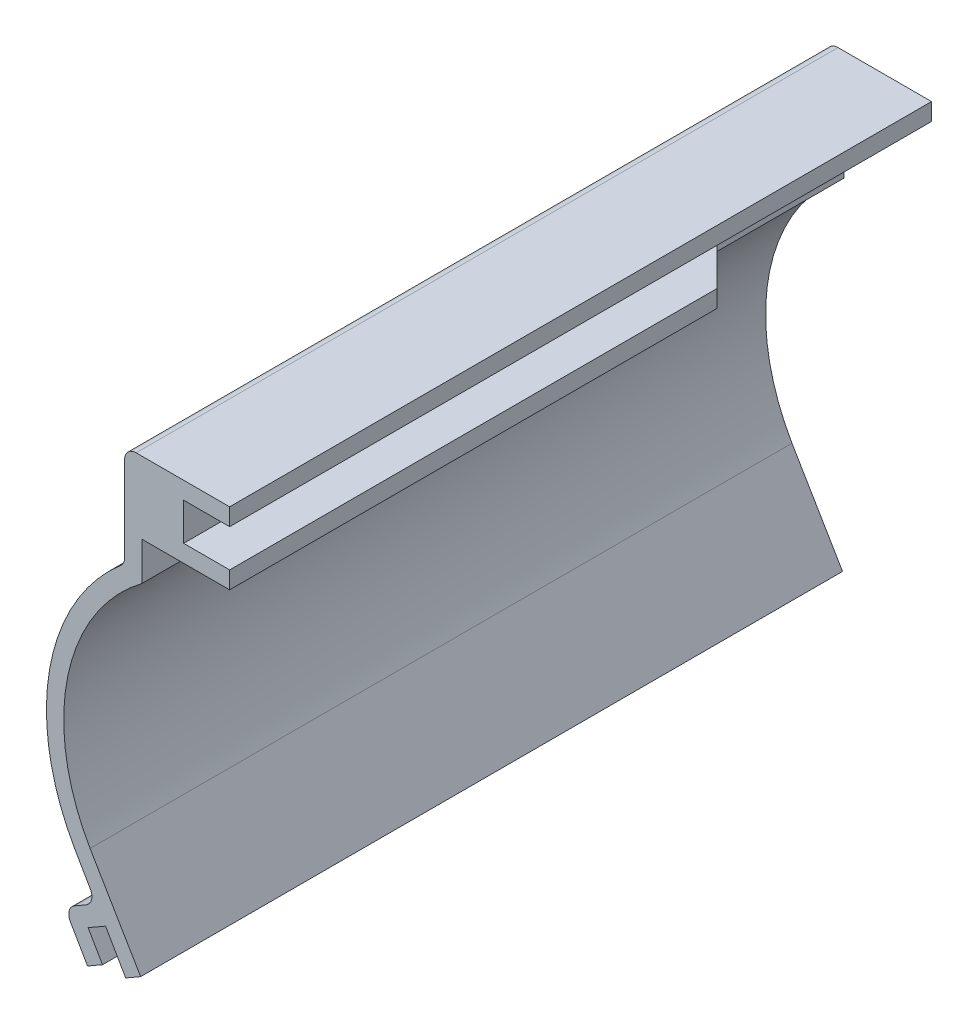
ISO-10303-21;
HEADER;
FILE_DESCRIPTION(('STEP AP214'),'2;1');
FILE_NAME('part.step','',(''),(''),'','','');
FILE_SCHEMA(('AUTOMOTIVE_DESIGN { 1 0 10303 214 1 1 1 1 }'));
ENDSEC;
DATA;
#1=APPLICATION_CONTEXT('core data for automotive mechanical design processes');
#2=APPLICATION_PROTOCOL_DEFINITION('international standard','automotive_design',2000,#1);
#3=PRODUCT_CONTEXT('',#1,'mechanical');
#4=PRODUCT('Part','Part','',(#3));
#5=PRODUCT_RELATED_PRODUCT_CATEGORY('part','',(#4));
#6=PRODUCT_DEFINITION_FORMATION('','',#4);
#7=PRODUCT_DEFINITION_CONTEXT('part definition',#1,'design');
#8=PRODUCT_DEFINITION('design','',#6,#7);
#9=PRODUCT_DEFINITION_SHAPE('','',#8);
#10=(LENGTH_UNIT() NAMED_UNIT(*) SI_UNIT(.MILLI.,.METRE.));
#11=(NAMED_UNIT(*) PLANE_ANGLE_UNIT() SI_UNIT($,.RADIAN.));
#12=(NAMED_UNIT(*) SI_UNIT($,.STERADIAN.) SOLID_ANGLE_UNIT());
#13=UNCERTAINTY_MEASURE_WITH_UNIT(LENGTH_MEASURE(1.E-05),#10,'distance_accuracy_value','');
#14=(GEOMETRIC_REPRESENTATION_CONTEXT(3) GLOBAL_UNCERTAINTY_ASSIGNED_CONTEXT((#13)) GLOBAL_UNIT_ASSIGNED_CONTEXT((#10,
#11,#12)) REPRESENTATION_CONTEXT('',''));
#15=CARTESIAN_POINT('',(0.,0.,0.));
#16=DIRECTION('',(0.,0.,1.));
#17=DIRECTION('',(1.,0.,0.));
#18=AXIS2_PLACEMENT_3D('',#15,#16,#17);
#19=CARTESIAN_POINT('',(-16.4489778170774,50.5859978889031,122.));
#20=DIRECTION('',(0.,1.,0.));
#21=DIRECTION('',(-1.,0.,0.));
#22=AXIS2_PLACEMENT_3D('',#19,#20,#21);
#23=PLANE('',#22);
#24=DIRECTION('',(1.,0.,0.));
#25=VECTOR('',#24,1.);
#26=CARTESIAN_POINT('',(-16.4489778170774,50.5859978889031,0.));
#27=LINE('',#26,#25);
#28=CARTESIAN_POINT('',(-24.4489778170773,50.5859978889031,0.));
#29=VERTEX_POINT('',#28);
#30=CARTESIAN_POINT('',(-16.4489778170774,50.5859978889031,0.));
#31=VERTEX_POINT('',#30);
#32=EDGE_CURVE('E247',#29,#31,#27,.T.);
#33=ORIENTED_EDGE('',*,*,#32,.T.);
#34=DIRECTION('',(0.,0.,-1.));
#35=VECTOR('',#34,1.);
#36=CARTESIAN_POINT('',(-16.4489778170774,50.5859978889031,122.));
#37=LINE('',#36,#35);
#38=CARTESIAN_POINT('',(-16.4489778170774,50.5859978889031,122.));
#39=VERTEX_POINT('',#38);
#40=EDGE_CURVE('E354',#39,#31,#37,.T.);
#41=ORIENTED_EDGE('',*,*,#40,.F.);
#42=DIRECTION('',(1.,0.,0.));
#43=VECTOR('',#42,1.);
#44=CARTESIAN_POINT('',(-16.4489778170774,50.5859978889031,122.));
#45=LINE('',#44,#43);
#46=CARTESIAN_POINT('',(-24.4489778170773,50.5859978889031,122.));
#47=VERTEX_POINT('',#46);
#48=EDGE_CURVE('E294',#47,#39,#45,.T.);
#49=ORIENTED_EDGE('',*,*,#48,.F.);
#50=DIRECTION('',(0.,0.,-1.));
#51=VECTOR('',#50,1.);
#52=CARTESIAN_POINT('',(-24.4489778170773,50.5859978889031,122.));
#53=LINE('',#52,#51);
#54=EDGE_CURVE('E241',#47,#29,#53,.T.);
#55=ORIENTED_EDGE('',*,*,#54,.T.);
#56=EDGE_LOOP('',(#33,#41,#49,#55));
#57=FACE_BOUND('',#56,.T.);
#58=ADVANCED_FACE('F43',(#57),#23,.F.);
#59=CARTESIAN_POINT('',(-16.4489778170774,53.5859978889031,122.));
#60=DIRECTION('',(-1.,0.,0.));
#61=DIRECTION('',(0.,0.,1.));
#62=AXIS2_PLACEMENT_3D('',#59,#60,#61);
#63=PLANE('',#62);
#64=DIRECTION('',(0.,1.,0.));
#65=VECTOR('',#64,1.);
#66=CARTESIAN_POINT('',(-16.4489778170774,53.5859978889031,0.));
#67=LINE('',#66,#65);
#68=CARTESIAN_POINT('',(-16.4489778170774,53.5859978889031,0.));
#69=VERTEX_POINT('',#68);
#70=EDGE_CURVE('E250',#31,#69,#67,.T.);
#71=ORIENTED_EDGE('',*,*,#70,.T.);
#72=DIRECTION('',(0.,0.,-1.));
#73=VECTOR('',#72,1.);
#74=CARTESIAN_POINT('',(-16.4489778170774,53.5859978889031,122.));
#75=LINE('',#74,#73);
#76=CARTESIAN_POINT('',(-16.4489778170774,53.5859978889031,122.));
#77=VERTEX_POINT('',#76);
#78=EDGE_CURVE('E351',#77,#69,#75,.T.);
#79=ORIENTED_EDGE('',*,*,#78,.F.);
#80=DIRECTION('',(0.,1.,0.));
#81=VECTOR('',#80,1.);
#82=CARTESIAN_POINT('',(-16.4489778170774,53.5859978889031,122.));
#83=LINE('',#82,#81);
#84=EDGE_CURVE('E389',#39,#77,#83,.T.);
#85=ORIENTED_EDGE('',*,*,#84,.F.);
#86=ORIENTED_EDGE('',*,*,#40,.T.);
#87=EDGE_LOOP('',(#71,#79,#85,#86));
#88=FACE_BOUND('',#87,.T.);
#89=ADVANCED_FACE('F508',(#88),#63,.F.);
#90=CARTESIAN_POINT('',(-32.6989778170773,53.5859978889031,122.));
#91=DIRECTION('',(0.,-1.,0.));
#92=DIRECTION('',(1.,0.,0.));
#93=AXIS2_PLACEMENT_3D('',#90,#91,#92);
#94=PLANE('',#93);
#95=DIRECTION('',(-1.,0.,0.));
#96=VECTOR('',#95,1.);
#97=CARTESIAN_POINT('',(-32.6989778170773,53.5859978889031,0.));
#98=LINE('',#97,#96);
#99=CARTESIAN_POINT('',(-32.6989778170773,53.5859978889031,0.));
#100=VERTEX_POINT('',#99);
#101=EDGE_CURVE('E252',#69,#100,#98,.T.);
#102=ORIENTED_EDGE('',*,*,#101,.T.);
#103=DIRECTION('',(0.,0.,-1.));
#104=VECTOR('',#103,1.);
#105=CARTESIAN_POINT('',(-32.6989778170773,53.5859978889031,122.));
#106=LINE('',#105,#104);
#107=CARTESIAN_POINT('',(-32.6989778170773,53.5859978889031,122.));
#108=VERTEX_POINT('',#107);
#109=EDGE_CURVE('E348',#108,#100,#106,.T.);
#110=ORIENTED_EDGE('',*,*,#109,.F.);
#111=DIRECTION('',(-1.,0.,0.));
#112=VECTOR('',#111,1.);
#113=CARTESIAN_POINT('',(-32.6989778170773,53.5859978889031,122.));
#114=LINE('',#113,#112);
#115=EDGE_CURVE('E391',#77,#108,#114,.T.);
#116=ORIENTED_EDGE('',*,*,#115,.F.);
#117=ORIENTED_EDGE('',*,*,#78,.T.);
#118=EDGE_LOOP('',(#102,#110,#116,#117));
#119=FACE_BOUND('',#118,.T.);
#120=ADVANCED_FACE('F505',(#119),#94,.F.);
#121=CARTESIAN_POINT('',(-32.6989778170773,51.5859978889031,122.));
#122=DIRECTION('',(0.,0.,-1.));
#123=DIRECTION('',(-1.,0.,0.));
#124=AXIS2_PLACEMENT_3D('',#121,#122,#123);
#125=CYLINDRICAL_SURFACE('',#124,2.00000000000001);
#126=CARTESIAN_POINT('',(-32.6989778170773,51.5859978889031,0.));
#127=DIRECTION('',(0.,0.,1.));
#128=DIRECTION('',(-1.,0.,0.));
#129=AXIS2_PLACEMENT_3D('',#126,#127,#128);
#130=CIRCLE('',#129,2.00000000000001);
#131=CARTESIAN_POINT('',(-34.6989778170773,51.5859978889031,0.));
#132=VERTEX_POINT('',#131);
#133=EDGE_CURVE('E254',#100,#132,#130,.T.);
#134=ORIENTED_EDGE('',*,*,#133,.T.);
#135=DIRECTION('',(0.,0.,-1.));
#136=VECTOR('',#135,1.);
#137=CARTESIAN_POINT('',(-34.6989778170773,51.5859978889031,122.));
#138=LINE('',#137,#136);
#139=CARTESIAN_POINT('',(-34.6989778170773,51.5859978889031,122.));
#140=VERTEX_POINT('',#139);
#141=EDGE_CURVE('E345',#140,#132,#138,.T.);
#142=ORIENTED_EDGE('',*,*,#141,.F.);
#143=CARTESIAN_POINT('',(-32.6989778170773,51.5859978889031,122.));
#144=DIRECTION('',(0.,0.,1.));
#145=DIRECTION('',(-1.,0.,0.));
#146=AXIS2_PLACEMENT_3D('',#143,#144,#145);
#147=CIRCLE('',#146,2.00000000000001);
#148=EDGE_CURVE('E396',#108,#140,#147,.T.);
#149=ORIENTED_EDGE('',*,*,#148,.F.);
#150=ORIENTED_EDGE('',*,*,#109,.T.);
#151=EDGE_LOOP('',(#134,#142,#149,#150));
#152=FACE_BOUND('',#151,.T.);
#153=ADVANCED_FACE('F501',(#152),#125,.T.);
#154=CARTESIAN_POINT('',(-34.6989778170773,36.8022063918843,122.));
#155=DIRECTION('',(1.,0.,0.));
#156=DIRECTION('',(0.,0.,-1.));
#157=AXIS2_PLACEMENT_3D('',#154,#155,#156);
#158=PLANE('',#157);
#159=DIRECTION('',(0.,-1.,0.));
#160=VECTOR('',#159,1.);
#161=CARTESIAN_POINT('',(-34.6989778170773,36.8022063918843,0.));
#162=LINE('',#161,#160);
#163=CARTESIAN_POINT('',(-34.6989778170773,36.8022063918843,0.));
#164=VERTEX_POINT('',#163);
#165=EDGE_CURVE('E256',#132,#164,#162,.T.);
#166=ORIENTED_EDGE('',*,*,#165,.T.);
#167=DIRECTION('',(0.,0.,-1.));
#168=VECTOR('',#167,1.);
#169=CARTESIAN_POINT('',(-34.6989778170773,36.8022063918843,122.));
#170=LINE('',#169,#168);
#171=CARTESIAN_POINT('',(-34.6989778170773,36.8022063918843,122.));
#172=VERTEX_POINT('',#171);
#173=EDGE_CURVE('E342',#172,#164,#170,.T.);
#174=ORIENTED_EDGE('',*,*,#173,.F.);
#175=DIRECTION('',(0.,-1.,0.));
#176=VECTOR('',#175,1.);
#177=CARTESIAN_POINT('',(-34.6989778170773,36.8022063918843,122.));
#178=LINE('',#177,#176);
#179=EDGE_CURVE('E398',#140,#172,#178,.T.);
#180=ORIENTED_EDGE('',*,*,#179,.F.);
#181=ORIENTED_EDGE('',*,*,#141,.T.);
#182=EDGE_LOOP('',(#166,#174,#180,#181));
#183=FACE_BOUND('',#182,.T.);
#184=ADVANCED_FACE('F496',(#183),#158,.F.);
#185=CARTESIAN_POINT('',(-36.6989778170773,36.8022063918843,122.));
#186=DIRECTION('',(0.,0.,-1.));
#187=DIRECTION('',(-1.,0.,0.));
#188=AXIS2_PLACEMENT_3D('',#185,#186,#187);
#189=CYLINDRICAL_SURFACE('',#188,2.);
#190=CARTESIAN_POINT('',(-36.6989778170773,36.8022063918843,0.));
#191=DIRECTION('',(0.,0.,-1.));
#192=DIRECTION('',(-1.,0.,0.));
#193=AXIS2_PLACEMENT_3D('',#190,#191,#192);
#194=CIRCLE('',#193,2.);
#195=CARTESIAN_POINT('',(-35.3924000451399,35.2879889286781,0.));
#196=VERTEX_POINT('',#195);
#197=EDGE_CURVE('E258',#164,#196,#194,.T.);
#198=ORIENTED_EDGE('',*,*,#197,.T.);
#199=DIRECTION('',(0.,0.,-1.));
#200=VECTOR('',#199,1.);
#201=CARTESIAN_POINT('',(-35.3924000451399,35.2879889286781,122.));
#202=LINE('',#201,#200);
#203=CARTESIAN_POINT('',(-35.3924000451399,35.2879889286781,122.));
#204=VERTEX_POINT('',#203);
#205=EDGE_CURVE('E339',#204,#196,#202,.T.);
#206=ORIENTED_EDGE('',*,*,#205,.F.);
#207=CARTESIAN_POINT('',(-36.6989778170773,36.8022063918843,122.));
#208=DIRECTION('',(0.,0.,-1.));
#209=DIRECTION('',(-1.,0.,0.));
#210=AXIS2_PLACEMENT_3D('',#207,#208,#209);
#211=CIRCLE('',#210,2.);
#212=EDGE_CURVE('E400',#172,#204,#211,.T.);
#213=ORIENTED_EDGE('',*,*,#212,.F.);
#214=ORIENTED_EDGE('',*,*,#173,.T.);
#215=EDGE_LOOP('',(#198,#206,#213,#214));
#216=FACE_BOUND('',#215,.T.);
#217=ADVANCED_FACE('F490',(#216),#189,.F.);
#218=CARTESIAN_POINT('',(-11.090053487103,7.12354411304068,122.));
#219=DIRECTION('',(0.,0.,-1.));
#220=DIRECTION('',(-1.,0.,0.));
#221=AXIS2_PLACEMENT_3D('',#218,#219,#220);
#222=CYLINDRICAL_SURFACE('',#221,37.2000000000002);
#223=CARTESIAN_POINT('',(-11.090053487103,7.12354411304068,0.));
#224=DIRECTION('',(0.,0.,1.));
#225=DIRECTION('',(1.,0.,0.));
#226=AXIS2_PLACEMENT_3D('',#223,#224,#225);
#227=CIRCLE('',#226,37.2000000000002);
#228=CARTESIAN_POINT('',(-43.3061985078843,-11.4764558869595,0.));
#229=VERTEX_POINT('',#228);
#230=EDGE_CURVE('E260',#196,#229,#227,.T.);
#231=ORIENTED_EDGE('',*,*,#230,.T.);
#232=DIRECTION('',(0.,0.,-1.));
#233=VECTOR('',#232,1.);
#234=CARTESIAN_POINT('',(-43.3061985078843,-11.4764558869595,122.));
#235=LINE('',#234,#233);
#236=CARTESIAN_POINT('',(-43.3061985078843,-11.4764558869595,122.));
#237=VERTEX_POINT('',#236);
#238=EDGE_CURVE('E336',#237,#229,#235,.T.);
#239=ORIENTED_EDGE('',*,*,#238,.F.);
#240=CARTESIAN_POINT('',(-11.090053487103,7.12354411304068,122.));
#241=DIRECTION('',(0.,0.,1.));
#242=DIRECTION('',(1.,0.,0.));
#243=AXIS2_PLACEMENT_3D('',#240,#241,#242);
#244=CIRCLE('',#243,37.2000000000002);
#245=EDGE_CURVE('E402',#204,#237,#244,.T.);
#246=ORIENTED_EDGE('',*,*,#245,.F.);
#247=ORIENTED_EDGE('',*,*,#205,.T.);
#248=EDGE_LOOP('',(#231,#239,#246,#247));
#249=FACE_BOUND('',#248,.T.);
#250=ADVANCED_FACE('F486',(#249),#222,.T.);
#251=CARTESIAN_POINT('',(-43.3061985078843,-11.4764558869595,122.));
#252=DIRECTION('',(0.866025403784437,0.500000000000003,0.));
#253=DIRECTION('',(-0.500000000000003,0.866025403784437,0.));
#254=AXIS2_PLACEMENT_3D('',#251,#252,#253);
#255=PLANE('',#254);
#256=DIRECTION('',(0.500000000000003,-0.866025403784437,0.));
#257=VECTOR('',#256,1.);
#258=CARTESIAN_POINT('',(-43.3061985078843,-11.4764558869595,0.));
#259=LINE('',#258,#257);
#260=CARTESIAN_POINT('',(-40.6561985078843,-16.0663905270169,0.));
#261=VERTEX_POINT('',#260);
#262=EDGE_CURVE('E262',#229,#261,#259,.T.);
#263=ORIENTED_EDGE('',*,*,#262,.T.);
#264=DIRECTION('',(0.,0.,-1.));
#265=VECTOR('',#264,1.);
#266=CARTESIAN_POINT('',(-40.6561985078843,-16.0663905270169,122.));
#267=LINE('',#266,#265);
#268=CARTESIAN_POINT('',(-40.6561985078843,-16.0663905270169,122.));
#269=VERTEX_POINT('',#268);
#270=EDGE_CURVE('E333',#269,#261,#267,.T.);
#271=ORIENTED_EDGE('',*,*,#270,.F.);
#272=DIRECTION('',(0.500000000000003,-0.866025403784437,0.));
#273=VECTOR('',#272,1.);
#274=CARTESIAN_POINT('',(-43.3061985078843,-11.4764558869595,122.));
#275=LINE('',#274,#273);
#276=EDGE_CURVE('E404',#237,#269,#275,.T.);
#277=ORIENTED_EDGE('',*,*,#276,.F.);
#278=ORIENTED_EDGE('',*,*,#238,.T.);
#279=EDGE_LOOP('',(#263,#271,#277,#278));
#280=FACE_BOUND('',#279,.T.);
#281=ADVANCED_FACE('F481',(#280),#255,.F.);
#282=CARTESIAN_POINT('',(-42.3882493154532,-17.066390527017,122.));
#283=DIRECTION('',(0.,0.,-1.));
#284=DIRECTION('',(-1.,0.,0.));
#285=AXIS2_PLACEMENT_3D('',#282,#283,#284);
#286=CYLINDRICAL_SURFACE('',#285,2.);
#287=CARTESIAN_POINT('',(-42.3882493154532,-17.066390527017,0.));
#288=DIRECTION('',(0.,0.,-1.));
#289=DIRECTION('',(1.,0.,0.));
#290=AXIS2_PLACEMENT_3D('',#287,#288,#289);
#291=CIRCLE('',#290,2.);
#292=CARTESIAN_POINT('',(-41.3882493154532,-18.7984413345858,0.));
#293=VERTEX_POINT('',#292);
#294=EDGE_CURVE('E264',#261,#293,#291,.T.);
#295=ORIENTED_EDGE('',*,*,#294,.T.);
#296=DIRECTION('',(0.,0.,-1.));
#297=VECTOR('',#296,1.);
#298=CARTESIAN_POINT('',(-41.3882493154532,-18.7984413345858,122.));
#299=LINE('',#298,#297);
#300=CARTESIAN_POINT('',(-41.3882493154532,-18.7984413345858,122.));
#301=VERTEX_POINT('',#300);
#302=EDGE_CURVE('E330',#301,#293,#299,.T.);
#303=ORIENTED_EDGE('',*,*,#302,.F.);
#304=CARTESIAN_POINT('',(-42.3882493154532,-17.066390527017,122.));
#305=DIRECTION('',(0.,0.,-1.));
#306=DIRECTION('',(1.,0.,0.));
#307=AXIS2_PLACEMENT_3D('',#304,#305,#306);
#308=CIRCLE('',#307,2.);
#309=EDGE_CURVE('E406',#269,#301,#308,.T.);
#310=ORIENTED_EDGE('',*,*,#309,.F.);
#311=ORIENTED_EDGE('',*,*,#270,.T.);
#312=EDGE_LOOP('',(#295,#303,#310,#311));
#313=FACE_BOUND('',#312,.T.);
#314=ADVANCED_FACE('F475',(#313),#286,.F.);
#315=CARTESIAN_POINT('',(-41.3882493154532,-18.7984413345858,122.));
#316=DIRECTION('',(0.500000000000002,-0.866025403784437,0.));
#317=DIRECTION('',(0.866025403784437,0.500000000000002,0.));
#318=AXIS2_PLACEMENT_3D('',#315,#316,#317);
#319=PLANE('',#318);
#320=DIRECTION('',(-0.866025403784437,-0.500000000000002,0.));
#321=VECTOR('',#320,1.);
#322=CARTESIAN_POINT('',(-41.3882493154532,-18.7984413345858,0.));
#323=LINE('',#322,#321);
#324=CARTESIAN_POINT('',(-43.4125836967992,-19.9671913345858,0.));
#325=VERTEX_POINT('',#324);
#326=EDGE_CURVE('E266',#293,#325,#323,.T.);
#327=ORIENTED_EDGE('',*,*,#326,.T.);
#328=DIRECTION('',(0.,0.,-1.));
#329=VECTOR('',#328,1.);
#330=CARTESIAN_POINT('',(-43.4125836967992,-19.9671913345858,122.));
#331=LINE('',#330,#329);
#332=CARTESIAN_POINT('',(-43.4125836967992,-19.9671913345858,122.));
#333=VERTEX_POINT('',#332);
#334=EDGE_CURVE('E327',#333,#325,#331,.T.);
#335=ORIENTED_EDGE('',*,*,#334,.F.);
#336=DIRECTION('',(-0.866025403784437,-0.500000000000002,0.));
#337=VECTOR('',#336,1.);
#338=CARTESIAN_POINT('',(-41.3882493154532,-18.7984413345858,122.));
#339=LINE('',#338,#337);
#340=EDGE_CURVE('E408',#301,#333,#339,.T.);
#341=ORIENTED_EDGE('',*,*,#340,.F.);
#342=ORIENTED_EDGE('',*,*,#302,.T.);
#343=EDGE_LOOP('',(#327,#335,#341,#342));
#344=FACE_BOUND('',#343,.T.);
#345=ADVANCED_FACE('F471',(#344),#319,.F.);
#346=CARTESIAN_POINT('',(-42.4125836967992,-21.6992421421546,122.));
#347=DIRECTION('',(0.,0.,-1.));
#348=DIRECTION('',(-1.,0.,0.));
#349=AXIS2_PLACEMENT_3D('',#346,#347,#348);
#350=CYLINDRICAL_SURFACE('',#349,2.);
#351=CARTESIAN_POINT('',(-42.4125836967992,-21.6992421421546,0.));
#352=DIRECTION('',(0.,0.,1.));
#353=DIRECTION('',(1.,0.,0.));
#354=AXIS2_PLACEMENT_3D('',#351,#352,#353);
#355=CIRCLE('',#354,2.);
#356=CARTESIAN_POINT('',(-44.144634504368,-22.6992421421547,0.));
#357=VERTEX_POINT('',#356);
#358=EDGE_CURVE('E268',#325,#357,#355,.T.);
#359=ORIENTED_EDGE('',*,*,#358,.T.);
#360=DIRECTION('',(0.,0.,-1.));
#361=VECTOR('',#360,1.);
#362=CARTESIAN_POINT('',(-44.144634504368,-22.6992421421547,122.));
#363=LINE('',#362,#361);
#364=CARTESIAN_POINT('',(-44.144634504368,-22.6992421421547,122.));
#365=VERTEX_POINT('',#364);
#366=EDGE_CURVE('E324',#365,#357,#363,.T.);
#367=ORIENTED_EDGE('',*,*,#366,.F.);
#368=CARTESIAN_POINT('',(-42.4125836967992,-21.6992421421546,122.));
#369=DIRECTION('',(0.,0.,1.));
#370=DIRECTION('',(1.,0.,0.));
#371=AXIS2_PLACEMENT_3D('',#368,#369,#370);
#372=CIRCLE('',#371,2.);
#373=EDGE_CURVE('E410',#333,#365,#372,.T.);
#374=ORIENTED_EDGE('',*,*,#373,.F.);
#375=ORIENTED_EDGE('',*,*,#334,.T.);
#376=EDGE_LOOP('',(#359,#367,#374,#375));
#377=FACE_BOUND('',#376,.T.);
#378=ADVANCED_FACE('F466',(#377),#350,.T.);
#379=CARTESIAN_POINT('',(-44.144634504368,-22.6992421421547,122.));
#380=DIRECTION('',(0.866025403784438,0.500000000000001,0.));
#381=DIRECTION('',(-0.500000000000001,0.866025403784438,0.));
#382=AXIS2_PLACEMENT_3D('',#379,#380,#381);
#383=PLANE('',#382);
#384=DIRECTION('',(0.500000000000001,-0.866025403784438,0.));
#385=VECTOR('',#384,1.);
#386=CARTESIAN_POINT('',(-44.144634504368,-22.6992421421547,0.));
#387=LINE('',#386,#385);
#388=CARTESIAN_POINT('',(-41.144634504368,-27.8953945648613,0.));
#389=VERTEX_POINT('',#388);
#390=EDGE_CURVE('E270',#357,#389,#387,.T.);
#391=ORIENTED_EDGE('',*,*,#390,.T.);
#392=DIRECTION('',(0.,0.,-1.));
#393=VECTOR('',#392,1.);
#394=CARTESIAN_POINT('',(-41.144634504368,-27.8953945648613,122.));
#395=LINE('',#394,#393);
#396=CARTESIAN_POINT('',(-41.144634504368,-27.8953945648613,122.));
#397=VERTEX_POINT('',#396);
#398=EDGE_CURVE('E321',#397,#389,#395,.T.);
#399=ORIENTED_EDGE('',*,*,#398,.F.);
#400=DIRECTION('',(0.500000000000001,-0.866025403784438,0.));
#401=VECTOR('',#400,1.);
#402=CARTESIAN_POINT('',(-44.144634504368,-22.6992421421547,122.));
#403=LINE('',#402,#401);
#404=EDGE_CURVE('E412',#365,#397,#403,.T.);
#405=ORIENTED_EDGE('',*,*,#404,.F.);
#406=ORIENTED_EDGE('',*,*,#366,.T.);
#407=EDGE_LOOP('',(#391,#399,#405,#406));
#408=FACE_BOUND('',#407,.T.);
#409=ADVANCED_FACE('F460',(#408),#383,.F.);
#410=CARTESIAN_POINT('',(-41.144634504368,-27.8953945648613,122.));
#411=DIRECTION('',(-0.5,0.866025403784438,0.));
#412=DIRECTION('',(-0.866025403784438,-0.5,0.));
#413=AXIS2_PLACEMENT_3D('',#410,#411,#412);
#414=PLANE('',#413);
#415=DIRECTION('',(0.866025403784438,0.5,0.));
#416=VECTOR('',#415,1.);
#417=CARTESIAN_POINT('',(-41.144634504368,-27.8953945648613,0.));
#418=LINE('',#417,#416);
#419=CARTESIAN_POINT('',(-38.5465582930147,-26.3953945648613,0.));
#420=VERTEX_POINT('',#419);
#421=EDGE_CURVE('E272',#389,#420,#418,.T.);
#422=ORIENTED_EDGE('',*,*,#421,.T.);
#423=DIRECTION('',(0.,0.,-1.));
#424=VECTOR('',#423,1.);
#425=CARTESIAN_POINT('',(-38.5465582930147,-26.3953945648613,122.));
#426=LINE('',#425,#424);
#427=CARTESIAN_POINT('',(-38.5465582930147,-26.3953945648613,122.));
#428=VERTEX_POINT('',#427);
#429=EDGE_CURVE('E318',#428,#420,#426,.T.);
#430=ORIENTED_EDGE('',*,*,#429,.F.);
#431=DIRECTION('',(0.866025403784438,0.5,0.));
#432=VECTOR('',#431,1.);
#433=CARTESIAN_POINT('',(-41.144634504368,-27.8953945648613,122.));
#434=LINE('',#433,#432);
#435=EDGE_CURVE('E414',#397,#428,#434,.T.);
#436=ORIENTED_EDGE('',*,*,#435,.F.);
#437=ORIENTED_EDGE('',*,*,#398,.T.);
#438=EDGE_LOOP('',(#422,#430,#436,#437));
#439=FACE_BOUND('',#438,.T.);
#440=ADVANCED_FACE('F456',(#439),#414,.F.);
#441=CARTESIAN_POINT('',(-38.5465582930147,-26.3953945648613,122.));
#442=DIRECTION('',(-0.866025403784436,-0.500000000000004,0.));
#443=DIRECTION('',(0.500000000000004,-0.866025403784437,0.));
#444=AXIS2_PLACEMENT_3D('',#441,#442,#443);
#445=PLANE('',#444);
#446=DIRECTION('',(-0.500000000000004,0.866025403784436,0.));
#447=VECTOR('',#446,1.);
#448=CARTESIAN_POINT('',(-38.5465582930147,-26.3953945648613,0.));
#449=LINE('',#448,#447);
#450=CARTESIAN_POINT('',(-41.0465582930147,-22.0652675459391,0.));
#451=VERTEX_POINT('',#450);
#452=EDGE_CURVE('E274',#420,#451,#449,.T.);
#453=ORIENTED_EDGE('',*,*,#452,.T.);
#454=DIRECTION('',(0.,0.,-1.));
#455=VECTOR('',#454,1.);
#456=CARTESIAN_POINT('',(-41.0465582930147,-22.0652675459391,122.));
#457=LINE('',#456,#455);
#458=CARTESIAN_POINT('',(-41.0465582930147,-22.0652675459391,122.));
#459=VERTEX_POINT('',#458);
#460=EDGE_CURVE('E315',#459,#451,#457,.T.);
#461=ORIENTED_EDGE('',*,*,#460,.F.);
#462=DIRECTION('',(-0.500000000000004,0.866025403784436,0.));
#463=VECTOR('',#462,1.);
#464=CARTESIAN_POINT('',(-38.5465582930147,-26.3953945648613,122.));
#465=LINE('',#464,#463);
#466=EDGE_CURVE('E416',#428,#459,#465,.T.);
#467=ORIENTED_EDGE('',*,*,#466,.F.);
#468=ORIENTED_EDGE('',*,*,#429,.T.);
#469=EDGE_LOOP('',(#453,#461,#467,#468));
#470=FACE_BOUND('',#469,.T.);
#471=ADVANCED_FACE('F451',(#470),#445,.F.);
#472=CARTESIAN_POINT('',(-41.0465582930147,-22.0652675459391,122.));
#473=DIRECTION('',(-0.5,0.866025403784438,0.));
#474=DIRECTION('',(-0.866025403784439,-0.5,0.));
#475=AXIS2_PLACEMENT_3D('',#472,#473,#474);
#476=PLANE('',#475);
#477=DIRECTION('',(0.866025403784438,0.5,0.));
#478=VECTOR('',#477,1.);
#479=CARTESIAN_POINT('',(-41.0465582930147,-22.0652675459391,0.));
#480=LINE('',#479,#478);
#481=CARTESIAN_POINT('',(-38.0154693797692,-20.3152675459391,0.));
#482=VERTEX_POINT('',#481);
#483=EDGE_CURVE('E276',#451,#482,#480,.T.);
#484=ORIENTED_EDGE('',*,*,#483,.T.);
#485=DIRECTION('',(0.,0.,-1.));
#486=VECTOR('',#485,1.);
#487=CARTESIAN_POINT('',(-38.0154693797692,-20.3152675459391,122.));
#488=LINE('',#487,#486);
#489=CARTESIAN_POINT('',(-38.0154693797692,-20.3152675459391,122.));
#490=VERTEX_POINT('',#489);
#491=EDGE_CURVE('E312',#490,#482,#488,.T.);
#492=ORIENTED_EDGE('',*,*,#491,.F.);
#493=DIRECTION('',(0.866025403784438,0.5,0.));
#494=VECTOR('',#493,1.);
#495=CARTESIAN_POINT('',(-41.0465582930147,-22.0652675459391,122.));
#496=LINE('',#495,#494);
#497=EDGE_CURVE('E418',#459,#490,#496,.T.);
#498=ORIENTED_EDGE('',*,*,#497,.F.);
#499=ORIENTED_EDGE('',*,*,#460,.T.);
#500=EDGE_LOOP('',(#484,#492,#498,#499));
#501=FACE_BOUND('',#500,.T.);
#502=ADVANCED_FACE('F445',(#501),#476,.F.);
#503=CARTESIAN_POINT('',(-38.0154693797692,-20.3152675459391,122.));
#504=DIRECTION('',(0.866025403784437,0.500000000000003,0.));
#505=DIRECTION('',(-0.500000000000003,0.866025403784437,0.));
#506=AXIS2_PLACEMENT_3D('',#503,#504,#505);
#507=PLANE('',#506);
#508=DIRECTION('',(0.500000000000003,-0.866025403784437,0.));
#509=VECTOR('',#508,1.);
#510=CARTESIAN_POINT('',(-38.0154693797692,-20.3152675459391,0.));
#511=LINE('',#510,#509);
#512=CARTESIAN_POINT('',(-34.5154693797692,-26.3774453724301,0.));
#513=VERTEX_POINT('',#512);
#514=EDGE_CURVE('E278',#482,#513,#511,.T.);
#515=ORIENTED_EDGE('',*,*,#514,.T.);
#516=DIRECTION('',(0.,0.,-1.));
#517=VECTOR('',#516,1.);
#518=CARTESIAN_POINT('',(-34.5154693797692,-26.3774453724301,122.));
#519=LINE('',#518,#517);
#520=CARTESIAN_POINT('',(-34.5154693797692,-26.3774453724301,122.));
#521=VERTEX_POINT('',#520);
#522=EDGE_CURVE('E309',#521,#513,#519,.T.);
#523=ORIENTED_EDGE('',*,*,#522,.F.);
#524=DIRECTION('',(0.500000000000003,-0.866025403784437,0.));
#525=VECTOR('',#524,1.);
#526=CARTESIAN_POINT('',(-38.0154693797692,-20.3152675459391,122.));
#527=LINE('',#526,#525);
#528=EDGE_CURVE('E420',#490,#521,#527,.T.);
#529=ORIENTED_EDGE('',*,*,#528,.F.);
#530=ORIENTED_EDGE('',*,*,#491,.T.);
#531=EDGE_LOOP('',(#515,#523,#529,#530));
#532=FACE_BOUND('',#531,.T.);
#533=ADVANCED_FACE('F441',(#532),#507,.F.);
#534=CARTESIAN_POINT('',(-34.5154693797692,-26.3774453724301,122.));
#535=DIRECTION('',(-0.500000000000002,0.866025403784437,0.));
#536=DIRECTION('',(-0.866025403784437,-0.500000000000002,0.));
#537=AXIS2_PLACEMENT_3D('',#534,#535,#536);
#538=PLANE('',#537);
#539=DIRECTION('',(0.866025403784437,0.500000000000002,0.));
#540=VECTOR('',#539,1.);
#541=CARTESIAN_POINT('',(-34.5154693797692,-26.3774453724301,0.));
#542=LINE('',#541,#540);
#543=CARTESIAN_POINT('',(-31.9173931684159,-24.8774453724301,0.));
#544=VERTEX_POINT('',#543);
#545=EDGE_CURVE('E280',#513,#544,#542,.T.);
#546=ORIENTED_EDGE('',*,*,#545,.T.);
#547=DIRECTION('',(0.,0.,-1.));
#548=VECTOR('',#547,1.);
#549=CARTESIAN_POINT('',(-31.9173931684159,-24.8774453724301,122.));
#550=LINE('',#549,#548);
#551=CARTESIAN_POINT('',(-31.9173931684159,-24.8774453724301,122.));
#552=VERTEX_POINT('',#551);
#553=EDGE_CURVE('E306',#552,#544,#550,.T.);
#554=ORIENTED_EDGE('',*,*,#553,.F.);
#555=DIRECTION('',(0.866025403784437,0.500000000000002,0.));
#556=VECTOR('',#555,1.);
#557=CARTESIAN_POINT('',(-34.5154693797692,-26.3774453724301,122.));
#558=LINE('',#557,#556);
#559=EDGE_CURVE('E422',#521,#552,#558,.T.);
#560=ORIENTED_EDGE('',*,*,#559,.F.);
#561=ORIENTED_EDGE('',*,*,#522,.T.);
#562=EDGE_LOOP('',(#546,#554,#560,#561));
#563=FACE_BOUND('',#562,.T.);
#564=ADVANCED_FACE('F437',(#563),#538,.F.);
#565=CARTESIAN_POINT('',(-31.9173931684159,-24.8774453724301,122.));
#566=DIRECTION('',(-0.861290877137064,-0.508112216897476,0.));
#567=DIRECTION('',(0.508112216897476,-0.861290877137064,0.));
#568=AXIS2_PLACEMENT_3D('',#565,#566,#567);
#569=PLANE('',#568);
#570=DIRECTION('',(-0.508112216897476,0.861290877137064,0.));
#571=VECTOR('',#570,1.);
#572=CARTESIAN_POINT('',(-31.9173931684159,-24.8774453724301,0.));
#573=LINE('',#572,#571);
#574=CARTESIAN_POINT('',(-40.708122296531,-9.97645588695929,0.));
#575=VERTEX_POINT('',#574);
#576=EDGE_CURVE('E282',#544,#575,#573,.T.);
#577=ORIENTED_EDGE('',*,*,#576,.T.);
#578=DIRECTION('',(0.,0.,-1.));
#579=VECTOR('',#578,1.);
#580=CARTESIAN_POINT('',(-40.708122296531,-9.97645588695929,122.));
#581=LINE('',#580,#579);
#582=CARTESIAN_POINT('',(-40.708122296531,-9.97645588695929,122.));
#583=VERTEX_POINT('',#582);
#584=EDGE_CURVE('E303',#583,#575,#581,.T.);
#585=ORIENTED_EDGE('',*,*,#584,.F.);
#586=DIRECTION('',(-0.508112216897476,0.861290877137064,0.));
#587=VECTOR('',#586,1.);
#588=CARTESIAN_POINT('',(-31.9173931684159,-24.8774453724301,122.));
#589=LINE('',#588,#587);
#590=EDGE_CURVE('E243',#552,#583,#589,.T.);
#591=ORIENTED_EDGE('',*,*,#590,.F.);
#592=ORIENTED_EDGE('',*,*,#553,.T.);
#593=EDGE_LOOP('',(#577,#585,#591,#592));
#594=FACE_BOUND('',#593,.T.);
#595=ADVANCED_FACE('F428',(#594),#569,.F.);
#596=CARTESIAN_POINT('',(-11.0900534871031,7.12354411304068,122.));
#597=DIRECTION('',(0.,0.,-1.));
#598=DIRECTION('',(-1.,0.,0.));
#599=AXIS2_PLACEMENT_3D('',#596,#597,#598);
#600=CYLINDRICAL_SURFACE('',#599,34.2);
#601=CARTESIAN_POINT('',(-11.0900534871031,7.12354411304068,0.));
#602=DIRECTION('',(0.,0.,-1.));
#603=DIRECTION('',(1.,0.,0.));
#604=AXIS2_PLACEMENT_3D('',#601,#602,#603);
#605=CIRCLE('',#604,34.2);
#606=CARTESIAN_POINT('',(-31.6989778170773,34.4166245174472,0.));
#607=VERTEX_POINT('',#606);
#608=EDGE_CURVE('E284',#575,#607,#605,.T.);
#609=ORIENTED_EDGE('',*,*,#608,.T.);
#610=DIRECTION('',(0.,0.,-1.));
#611=VECTOR('',#610,1.);
#612=CARTESIAN_POINT('',(-31.6989778170773,34.4166245174472,122.));
#613=LINE('',#612,#611);
#614=CARTESIAN_POINT('',(-31.6989778170773,34.4166245174472,122.));
#615=VERTEX_POINT('',#614);
#616=EDGE_CURVE('E301',#615,#607,#613,.T.);
#617=ORIENTED_EDGE('',*,*,#616,.F.);
#618=CARTESIAN_POINT('',(-11.0900534871031,7.12354411304068,122.));
#619=DIRECTION('',(0.,0.,-1.));
#620=DIRECTION('',(1.,0.,0.));
#621=AXIS2_PLACEMENT_3D('',#618,#619,#620);
#622=CIRCLE('',#621,34.2);
#623=EDGE_CURVE('E237',#583,#615,#622,.T.);
#624=ORIENTED_EDGE('',*,*,#623,.F.);
#625=ORIENTED_EDGE('',*,*,#584,.T.);
#626=EDGE_LOOP('',(#609,#617,#624,#625));
#627=FACE_BOUND('',#626,.T.);
#628=ADVANCED_FACE('F432',(#627),#600,.F.);
#629=CARTESIAN_POINT('',(-31.6989778170773,47.6074172834728,122.));
#630=DIRECTION('',(-1.,0.,0.));
#631=DIRECTION('',(0.,-1.,0.));
#632=AXIS2_PLACEMENT_3D('',#629,#630,#631);
#633=PLANE('',#632);
#634=DIRECTION('',(0.,0.,-1.));
#635=VECTOR('',#634,1.);
#636=CARTESIAN_POINT('',(-31.6989778170773,47.6074172834728,122.));
#637=LINE('',#636,#635);
#638=CARTESIAN_POINT('',(-31.6989778170773,47.6074172834728,21.9999999999997));
#639=VERTEX_POINT('',#638);
#640=CARTESIAN_POINT('',(-31.6989778170773,47.6074172834728,0.));
#641=VERTEX_POINT('',#640);
#642=EDGE_CURVE('E299',#639,#641,#637,.T.);
#643=ORIENTED_EDGE('',*,*,#642,.F.);
#644=DIRECTION('',(0.,-1.,0.));
#645=VECTOR('',#644,1.);
#646=CARTESIAN_POINT('',(-31.6989778170773,47.6074172834728,21.9999999999996));
#647=LINE('',#646,#645);
#648=CARTESIAN_POINT('',(-31.6989778170773,41.0859978889031,21.9999999999996));
#649=VERTEX_POINT('',#648);
#650=EDGE_CURVE('E232',#639,#649,#647,.T.);
#651=ORIENTED_EDGE('',*,*,#650,.T.);
#652=DIRECTION('',(0.,0.,1.));
#653=VECTOR('',#652,1.);
#654=CARTESIAN_POINT('',(-31.6989778170773,41.0859978889031,42.));
#655=LINE('',#654,#653);
#656=CARTESIAN_POINT('',(-31.6989778170773,41.0859978889031,122.));
#657=VERTEX_POINT('',#656);
#658=EDGE_CURVE('E214',#649,#657,#655,.T.);
#659=ORIENTED_EDGE('',*,*,#658,.T.);
#660=DIRECTION('',(0.,1.,0.));
#661=VECTOR('',#660,1.);
#662=CARTESIAN_POINT('',(-31.6989778170773,47.6074172834728,122.));
#663=LINE('',#662,#661);
#664=EDGE_CURVE('E230',#615,#657,#663,.T.);
#665=ORIENTED_EDGE('',*,*,#664,.F.);
#666=ORIENTED_EDGE('',*,*,#616,.T.);
#667=DIRECTION('',(0.,1.,0.));
#668=VECTOR('',#667,1.);
#669=CARTESIAN_POINT('',(-31.6989778170773,47.6074172834728,0.));
#670=LINE('',#669,#668);
#671=EDGE_CURVE('E286',#607,#641,#670,.T.);
#672=ORIENTED_EDGE('',*,*,#671,.T.);
#673=EDGE_LOOP('',(#643,#651,#659,#665,#666,#672));
#674=FACE_BOUND('',#673,.T.);
#675=ADVANCED_FACE('F228',(#674),#633,.F.);
#676=CARTESIAN_POINT('',(-24.4489778170773,47.6074172834728,122.));
#677=DIRECTION('',(0.,1.,0.));
#678=DIRECTION('',(-1.,0.,0.));
#679=AXIS2_PLACEMENT_3D('',#676,#677,#678);
#680=PLANE('',#679);
#681=DIRECTION('',(0.,0.,-1.));
#682=VECTOR('',#681,1.);
#683=CARTESIAN_POINT('',(-24.4489778170773,47.6074172834728,122.));
#684=LINE('',#683,#682);
#685=CARTESIAN_POINT('',(-24.4489778170773,47.6074172834728,29.2499999999998));
#686=VERTEX_POINT('',#685);
#687=CARTESIAN_POINT('',(-24.4489778170773,47.6074172834728,0.));
#688=VERTEX_POINT('',#687);
#689=EDGE_CURVE('E297',#686,#688,#684,.T.);
#690=ORIENTED_EDGE('',*,*,#689,.F.);
#691=DIRECTION('',(-0.707106781186544,0.,-0.707106781186551));
#692=VECTOR('',#691,1.);
#693=CARTESIAN_POINT('',(-31.6989778170773,47.6074172834728,21.9999999999996));
#694=LINE('',#693,#692);
#695=EDGE_CURVE('E358',#686,#639,#694,.T.);
#696=ORIENTED_EDGE('',*,*,#695,.T.);
#697=ORIENTED_EDGE('',*,*,#642,.T.);
#698=DIRECTION('',(1.,0.,0.));
#699=VECTOR('',#698,1.);
#700=CARTESIAN_POINT('',(-24.4489778170773,47.6074172834728,0.));
#701=LINE('',#700,#699);
#702=EDGE_CURVE('E289',#641,#688,#701,.T.);
#703=ORIENTED_EDGE('',*,*,#702,.T.);
#704=EDGE_LOOP('',(#690,#696,#697,#703));
#705=FACE_BOUND('',#704,.T.);
#706=ADVANCED_FACE('F377',(#705),#680,.F.);
#707=CARTESIAN_POINT('',(-24.4489778170773,50.5859978889031,122.));
#708=DIRECTION('',(-1.,0.,0.));
#709=DIRECTION('',(0.,0.,1.));
#710=AXIS2_PLACEMENT_3D('',#707,#708,#709);
#711=PLANE('',#710);
#712=DIRECTION('',(0.,1.,0.));
#713=VECTOR('',#712,1.);
#714=CARTESIAN_POINT('',(-24.4489778170773,50.5859978889031,0.));
#715=LINE('',#714,#713);
#716=EDGE_CURVE('E292',#688,#29,#715,.T.);
#717=ORIENTED_EDGE('',*,*,#716,.T.);
#718=ORIENTED_EDGE('',*,*,#54,.F.);
#719=DIRECTION('',(0.,1.,0.));
#720=VECTOR('',#719,1.);
#721=CARTESIAN_POINT('',(-24.4489778170773,50.5859978889031,122.));
#722=LINE('',#721,#720);
#723=CARTESIAN_POINT('',(-24.4489778170773,44.0859978889031,122.));
#724=VERTEX_POINT('',#723);
#725=EDGE_CURVE('E239',#724,#47,#722,.T.);
#726=ORIENTED_EDGE('',*,*,#725,.F.);
#727=DIRECTION('',(0.,0.,1.));
#728=VECTOR('',#727,1.);
#729=CARTESIAN_POINT('',(-24.4489778170773,44.0859978889031,42.));
#730=LINE('',#729,#728);
#731=CARTESIAN_POINT('',(-24.4489778170773,44.0859978889031,29.2499999999997));
#732=VERTEX_POINT('',#731);
#733=EDGE_CURVE('E59',#732,#724,#730,.T.);
#734=ORIENTED_EDGE('',*,*,#733,.F.);
#735=DIRECTION('',(0.,1.,0.));
#736=VECTOR('',#735,1.);
#737=CARTESIAN_POINT('',(-24.4489778170773,50.5859978889031,29.2499999999997));
#738=LINE('',#737,#736);
#739=EDGE_CURVE('E11',#732,#686,#738,.T.);
#740=ORIENTED_EDGE('',*,*,#739,.T.);
#741=ORIENTED_EDGE('',*,*,#689,.T.);
#742=EDGE_LOOP('',(#717,#718,#726,#734,#740,#741));
#743=FACE_BOUND('',#742,.T.);
#744=ADVANCED_FACE('F375',(#743),#711,.F.);
#745=CARTESIAN_POINT('',(-11.0900534871031,7.12354411304068,122.));
#746=DIRECTION('',(0.,0.,1.));
#747=DIRECTION('',(1.,0.,0.));
#748=AXIS2_PLACEMENT_3D('',#745,#746,#747);
#749=PLANE('',#748);
#750=ORIENTED_EDGE('',*,*,#664,.T.);
#751=DIRECTION('',(1.,0.,0.));
#752=VECTOR('',#751,1.);
#753=CARTESIAN_POINT('',(-31.6989778170773,41.0859978889031,122.));
#754=LINE('',#753,#752);
#755=CARTESIAN_POINT('',(-16.4489778170774,41.0859978889031,122.));
#756=VERTEX_POINT('',#755);
#757=EDGE_CURVE('E210',#657,#756,#754,.T.);
#758=ORIENTED_EDGE('',*,*,#757,.T.);
#759=DIRECTION('',(0.,1.,0.));
#760=VECTOR('',#759,1.);
#761=CARTESIAN_POINT('',(-16.4489778170774,41.0859978889031,122.));
#762=LINE('',#761,#760);
#763=CARTESIAN_POINT('',(-16.4489778170774,44.0859978889031,122.));
#764=VERTEX_POINT('',#763);
#765=EDGE_CURVE('E222',#756,#764,#762,.T.);
#766=ORIENTED_EDGE('',*,*,#765,.T.);
#767=DIRECTION('',(-1.,0.,0.));
#768=VECTOR('',#767,1.);
#769=CARTESIAN_POINT('',(-16.4489778170774,44.0859978889031,122.));
#770=LINE('',#769,#768);
#771=EDGE_CURVE('E233',#764,#724,#770,.T.);
#772=ORIENTED_EDGE('',*,*,#771,.T.);
#773=ORIENTED_EDGE('',*,*,#725,.T.);
#774=ORIENTED_EDGE('',*,*,#48,.T.);
#775=ORIENTED_EDGE('',*,*,#84,.T.);
#776=ORIENTED_EDGE('',*,*,#115,.T.);
#777=ORIENTED_EDGE('',*,*,#148,.T.);
#778=ORIENTED_EDGE('',*,*,#179,.T.);
#779=ORIENTED_EDGE('',*,*,#212,.T.);
#780=ORIENTED_EDGE('',*,*,#245,.T.);
#781=ORIENTED_EDGE('',*,*,#276,.T.);
#782=ORIENTED_EDGE('',*,*,#309,.T.);
#783=ORIENTED_EDGE('',*,*,#340,.T.);
#784=ORIENTED_EDGE('',*,*,#373,.T.);
#785=ORIENTED_EDGE('',*,*,#404,.T.);
#786=ORIENTED_EDGE('',*,*,#435,.T.);
#787=ORIENTED_EDGE('',*,*,#466,.T.);
#788=ORIENTED_EDGE('',*,*,#497,.T.);
#789=ORIENTED_EDGE('',*,*,#528,.T.);
#790=ORIENTED_EDGE('',*,*,#559,.T.);
#791=ORIENTED_EDGE('',*,*,#590,.T.);
#792=ORIENTED_EDGE('',*,*,#623,.T.);
#793=EDGE_LOOP('',(#750,#758,#766,#772,#773,#774,#775,#776,#777,#778,#779,#780,#781,#782,#783,
#784,#785,#786,#787,#788,#789,#790,#791,#792));
#794=FACE_BOUND('',#793,.T.);
#795=ADVANCED_FACE('F235',(#794),#749,.T.);
#796=CARTESIAN_POINT('',(-11.0900534871031,7.12354411304068,0.));
#797=DIRECTION('',(0.,0.,1.));
#798=DIRECTION('',(1.,0.,0.));
#799=AXIS2_PLACEMENT_3D('',#796,#797,#798);
#800=PLANE('',#799);
#801=ORIENTED_EDGE('',*,*,#32,.F.);
#802=ORIENTED_EDGE('',*,*,#716,.F.);
#803=ORIENTED_EDGE('',*,*,#702,.F.);
#804=ORIENTED_EDGE('',*,*,#671,.F.);
#805=ORIENTED_EDGE('',*,*,#608,.F.);
#806=ORIENTED_EDGE('',*,*,#576,.F.);
#807=ORIENTED_EDGE('',*,*,#545,.F.);
#808=ORIENTED_EDGE('',*,*,#514,.F.);
#809=ORIENTED_EDGE('',*,*,#483,.F.);
#810=ORIENTED_EDGE('',*,*,#452,.F.);
#811=ORIENTED_EDGE('',*,*,#421,.F.);
#812=ORIENTED_EDGE('',*,*,#390,.F.);
#813=ORIENTED_EDGE('',*,*,#358,.F.);
#814=ORIENTED_EDGE('',*,*,#326,.F.);
#815=ORIENTED_EDGE('',*,*,#294,.F.);
#816=ORIENTED_EDGE('',*,*,#262,.F.);
#817=ORIENTED_EDGE('',*,*,#230,.F.);
#818=ORIENTED_EDGE('',*,*,#197,.F.);
#819=ORIENTED_EDGE('',*,*,#165,.F.);
#820=ORIENTED_EDGE('',*,*,#133,.F.);
#821=ORIENTED_EDGE('',*,*,#101,.F.);
#822=ORIENTED_EDGE('',*,*,#70,.F.);
#823=EDGE_LOOP('',(#801,#802,#803,#804,#805,#806,#807,#808,#809,#810,#811,#812,#813,#814,#815,
#816,#817,#818,#819,#820,#821,#822));
#824=FACE_BOUND('',#823,.T.);
#825=ADVANCED_FACE('F383',(#824),#800,.F.);
#826=CARTESIAN_POINT('',(-16.4489778170774,44.0859978889031,42.));
#827=DIRECTION('',(0.,1.,0.));
#828=DIRECTION('',(0.,0.,1.));
#829=AXIS2_PLACEMENT_3D('',#826,#827,#828);
#830=PLANE('',#829);
#831=ORIENTED_EDGE('',*,*,#771,.F.);
#832=DIRECTION('',(0.,0.,1.));
#833=VECTOR('',#832,1.);
#834=CARTESIAN_POINT('',(-16.4489778170774,44.0859978889031,42.));
#835=LINE('',#834,#833);
#836=CARTESIAN_POINT('',(-16.4489778170774,44.0859978889031,37.2499999999997));
#837=VERTEX_POINT('',#836);
#838=EDGE_CURVE('E370',#837,#764,#835,.T.);
#839=ORIENTED_EDGE('',*,*,#838,.F.);
#840=DIRECTION('',(-0.707106781186544,0.,-0.707106781186551));
#841=VECTOR('',#840,1.);
#842=CARTESIAN_POINT('',(-31.6989778170773,44.0859978889031,21.9999999999996));
#843=LINE('',#842,#841);
#844=EDGE_CURVE('E53',#837,#732,#843,.T.);
#845=ORIENTED_EDGE('',*,*,#844,.T.);
#846=ORIENTED_EDGE('',*,*,#733,.T.);
#847=EDGE_LOOP('',(#831,#839,#845,#846));
#848=FACE_BOUND('',#847,.T.);
#849=ADVANCED_FACE('F368',(#848),#830,.T.);
#850=CARTESIAN_POINT('',(-16.4489778170774,41.0859978889031,42.));
#851=DIRECTION('',(1.,0.,0.));
#852=DIRECTION('',(0.,0.,-1.));
#853=AXIS2_PLACEMENT_3D('',#850,#851,#852);
#854=PLANE('',#853);
#855=ORIENTED_EDGE('',*,*,#765,.F.);
#856=DIRECTION('',(0.,0.,1.));
#857=VECTOR('',#856,1.);
#858=CARTESIAN_POINT('',(-16.4489778170774,41.0859978889031,42.));
#859=LINE('',#858,#857);
#860=CARTESIAN_POINT('',(-16.4489778170774,41.0859978889031,37.2499999999997));
#861=VERTEX_POINT('',#860);
#862=EDGE_CURVE('E217',#861,#756,#859,.T.);
#863=ORIENTED_EDGE('',*,*,#862,.F.);
#864=DIRECTION('',(0.,1.,0.));
#865=VECTOR('',#864,1.);
#866=CARTESIAN_POINT('',(-16.4489778170774,47.6074172834729,37.2499999999997));
#867=LINE('',#866,#865);
#868=EDGE_CURVE('E362',#861,#837,#867,.T.);
#869=ORIENTED_EDGE('',*,*,#868,.T.);
#870=ORIENTED_EDGE('',*,*,#838,.T.);
#871=EDGE_LOOP('',(#855,#863,#869,#870));
#872=FACE_BOUND('',#871,.T.);
#873=ADVANCED_FACE('F561',(#872),#854,.T.);
#874=CARTESIAN_POINT('',(-31.6989778170773,41.0859978889031,42.));
#875=DIRECTION('',(0.,-1.,0.));
#876=DIRECTION('',(0.,0.,-1.));
#877=AXIS2_PLACEMENT_3D('',#874,#875,#876);
#878=PLANE('',#877);
#879=ORIENTED_EDGE('',*,*,#757,.F.);
#880=ORIENTED_EDGE('',*,*,#658,.F.);
#881=DIRECTION('',(0.707106781186544,0.,0.707106781186551));
#882=VECTOR('',#881,1.);
#883=CARTESIAN_POINT('',(-31.6989778170773,41.0859978889031,21.9999999999996));
#884=LINE('',#883,#882);
#885=EDGE_CURVE('E360',#649,#861,#884,.T.);
#886=ORIENTED_EDGE('',*,*,#885,.T.);
#887=ORIENTED_EDGE('',*,*,#862,.T.);
#888=EDGE_LOOP('',(#879,#880,#886,#887));
#889=FACE_BOUND('',#888,.T.);
#890=ADVANCED_FACE('F212',(#889),#878,.T.);
#891=CARTESIAN_POINT('',(-31.6989778170773,47.6074172834728,21.9999999999996));
#892=DIRECTION('',(-0.707106781186551,0.,0.707106781186544));
#893=DIRECTION('',(0.,-1.,0.));
#894=AXIS2_PLACEMENT_3D('',#891,#892,#893);
#895=PLANE('',#894);
#896=ORIENTED_EDGE('',*,*,#844,.F.);
#897=ORIENTED_EDGE('',*,*,#868,.F.);
#898=ORIENTED_EDGE('',*,*,#885,.F.);
#899=ORIENTED_EDGE('',*,*,#650,.F.);
#900=ORIENTED_EDGE('',*,*,#695,.F.);
#901=ORIENTED_EDGE('',*,*,#739,.F.);
#902=EDGE_LOOP('',(#896,#897,#898,#899,#900,#901));
#903=FACE_BOUND('',#902,.T.);
#904=ADVANCED_FACE('F46',(#903),#895,.F.);
#905=CLOSED_SHELL('',(#58,#89,#120,#153,#184,#217,#250,#281,#314,#345,#378,#409,#440,#471,#502,
#533,#564,#595,#628,#675,#706,#744,#795,#825,#849,#873,#890,#904));
#906=MANIFOLD_SOLID_BREP('B2',#905);
#907=ADVANCED_BREP_SHAPE_REPRESENTATION('',(#18,#906),#14);
#908=SHAPE_DEFINITION_REPRESENTATION(#9,#907);
ENDSEC;
END-ISO-10303-21;
